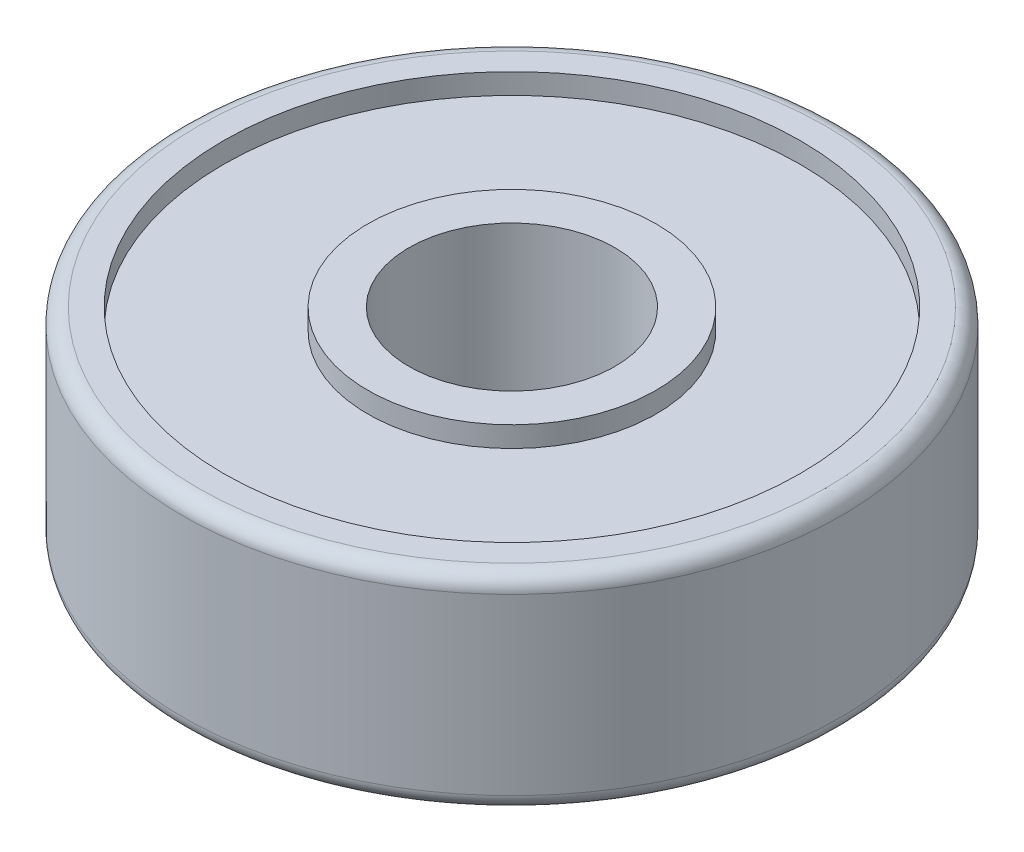
ISO-10303-21;
HEADER;
FILE_DESCRIPTION(('STEP AP214'),'2;1');
FILE_NAME('part.step','',(''),(''),'','','');
FILE_SCHEMA(('AUTOMOTIVE_DESIGN { 1 0 10303 214 1 1 1 1 }'));
ENDSEC;
DATA;
#1=APPLICATION_CONTEXT('core data for automotive mechanical design processes');
#2=APPLICATION_PROTOCOL_DEFINITION('international standard','automotive_design',2000,#1);
#3=PRODUCT_CONTEXT('',#1,'mechanical');
#4=PRODUCT('Part','Part','',(#3));
#5=PRODUCT_RELATED_PRODUCT_CATEGORY('part','',(#4));
#6=PRODUCT_DEFINITION_FORMATION('','',#4);
#7=PRODUCT_DEFINITION_CONTEXT('part definition',#1,'design');
#8=PRODUCT_DEFINITION('design','',#6,#7);
#9=PRODUCT_DEFINITION_SHAPE('','',#8);
#10=(LENGTH_UNIT() NAMED_UNIT(*) SI_UNIT(.MILLI.,.METRE.));
#11=(NAMED_UNIT(*) PLANE_ANGLE_UNIT() SI_UNIT($,.RADIAN.));
#12=(NAMED_UNIT(*) SI_UNIT($,.STERADIAN.) SOLID_ANGLE_UNIT());
#13=UNCERTAINTY_MEASURE_WITH_UNIT(LENGTH_MEASURE(1.E-05),#10,'distance_accuracy_value','');
#14=(GEOMETRIC_REPRESENTATION_CONTEXT(3) GLOBAL_UNCERTAINTY_ASSIGNED_CONTEXT((#13)) GLOBAL_UNIT_ASSIGNED_CONTEXT((#10,
#11,#12)) REPRESENTATION_CONTEXT('',''));
#15=CARTESIAN_POINT('',(0.,0.,0.));
#16=DIRECTION('',(0.,0.,1.));
#17=DIRECTION('',(1.,0.,0.));
#18=AXIS2_PLACEMENT_3D('',#15,#16,#17);
#19=CARTESIAN_POINT('',(0.,0.,0.));
#20=DIRECTION('',(0.,-1.,0.));
#21=DIRECTION('',(0.,0.,-1.));
#22=AXIS2_PLACEMENT_3D('',#19,#20,#21);
#23=TOROIDAL_SURFACE('',#22,5.2,1.75);
#24=ADVANCED_FACE('P0_F13',(),#23,.T.);
#25=CLOSED_SHELL('',(#24));
#26=MANIFOLD_SOLID_BREP('P0_B1',#25);
#27=CARTESIAN_POINT('',(0.,2.75,0.));
#28=DIRECTION('',(0.,-1.,0.));
#29=DIRECTION('',(0.,0.,-1.));
#30=AXIS2_PLACEMENT_3D('',#27,#28,#29);
#31=CYLINDRICAL_SURFACE('',#30,2.5);
#32=CARTESIAN_POINT('',(0.,-2.5,0.));
#33=DIRECTION('',(0.,-1.,0.));
#34=DIRECTION('',(0.,0.,-1.));
#35=AXIS2_PLACEMENT_3D('',#32,#33,#34);
#36=CIRCLE('',#35,2.5);
#37=CARTESIAN_POINT('',(0.,-2.5,-2.5));
#38=VERTEX_POINT('',#37);
#39=EDGE_CURVE('P1_E155',#38,#38,#36,.F.);
#40=ORIENTED_EDGE('',*,*,#39,.F.);
#41=EDGE_LOOP('',(#40));
#42=FACE_BOUND('',#41,.T.);
#43=CARTESIAN_POINT('',(0.,2.5,0.));
#44=DIRECTION('',(0.,-1.,0.));
#45=DIRECTION('',(0.,0.,-1.));
#46=AXIS2_PLACEMENT_3D('',#43,#44,#45);
#47=CIRCLE('',#46,2.5);
#48=CARTESIAN_POINT('',(0.,2.5,-2.5));
#49=VERTEX_POINT('',#48);
#50=EDGE_CURVE('P1_E17',#49,#49,#47,.F.);
#51=ORIENTED_EDGE('',*,*,#50,.T.);
#52=EDGE_LOOP('',(#51));
#53=FACE_BOUND('',#52,.T.);
#54=ADVANCED_FACE('P1_F14',(#42,#53),#31,.F.);
#55=CARTESIAN_POINT('',(0.,2.5,0.));
#56=DIRECTION('',(0.,-1.,0.));
#57=DIRECTION('',(0.,0.,-1.));
#58=AXIS2_PLACEMENT_3D('',#55,#56,#57);
#59=PLANE('',#58);
#60=ORIENTED_EDGE('',*,*,#50,.F.);
#61=EDGE_LOOP('',(#60));
#62=FACE_BOUND('',#61,.T.);
#63=CARTESIAN_POINT('',(0.,2.5,0.));
#64=DIRECTION('',(0.,-1.,0.));
#65=DIRECTION('',(0.,0.,-1.));
#66=AXIS2_PLACEMENT_3D('',#63,#64,#65);
#67=CIRCLE('',#66,3.5);
#68=CARTESIAN_POINT('',(0.,2.5,-3.5));
#69=VERTEX_POINT('',#68);
#70=EDGE_CURVE('P1_E153',#69,#69,#67,.T.);
#71=ORIENTED_EDGE('',*,*,#70,.F.);
#72=EDGE_LOOP('',(#71));
#73=FACE_BOUND('',#72,.T.);
#74=ADVANCED_FACE('P1_F108',(#62,#73),#59,.F.);
#75=CARTESIAN_POINT('',(0.,-2.5,0.));
#76=DIRECTION('',(0.,-1.,0.));
#77=DIRECTION('',(0.,0.,-1.));
#78=AXIS2_PLACEMENT_3D('',#75,#76,#77);
#79=PLANE('',#78);
#80=ORIENTED_EDGE('',*,*,#39,.T.);
#81=EDGE_LOOP('',(#80));
#82=FACE_BOUND('',#81,.T.);
#83=CARTESIAN_POINT('',(0.,-2.5,0.));
#84=DIRECTION('',(0.,-1.,0.));
#85=DIRECTION('',(0.,0.,-1.));
#86=AXIS2_PLACEMENT_3D('',#83,#84,#85);
#87=CIRCLE('',#86,3.5);
#88=CARTESIAN_POINT('',(0.,-2.5,-3.5));
#89=VERTEX_POINT('',#88);
#90=EDGE_CURVE('P1_E150',#89,#89,#87,.F.);
#91=ORIENTED_EDGE('',*,*,#90,.F.);
#92=EDGE_LOOP('',(#91));
#93=FACE_BOUND('',#92,.T.);
#94=ADVANCED_FACE('P1_F105',(#82,#93),#79,.T.);
#95=CARTESIAN_POINT('',(0.,2.75,0.));
#96=DIRECTION('',(0.,-1.,0.));
#97=DIRECTION('',(0.,0.,-1.));
#98=AXIS2_PLACEMENT_3D('',#95,#96,#97);
#99=CYLINDRICAL_SURFACE('',#98,3.5);
#100=ORIENTED_EDGE('',*,*,#70,.T.);
#101=EDGE_LOOP('',(#100));
#102=FACE_BOUND('',#101,.T.);
#103=CARTESIAN_POINT('',(0.,2.,0.));
#104=DIRECTION('',(0.,-1.,0.));
#105=DIRECTION('',(0.,0.,-1.));
#106=AXIS2_PLACEMENT_3D('',#103,#104,#105);
#107=CIRCLE('',#106,3.5);
#108=CARTESIAN_POINT('',(0.,2.,-3.5));
#109=VERTEX_POINT('',#108);
#110=EDGE_CURVE('P1_E147',#109,#109,#107,.F.);
#111=ORIENTED_EDGE('',*,*,#110,.T.);
#112=EDGE_LOOP('',(#111));
#113=FACE_BOUND('',#112,.T.);
#114=ADVANCED_FACE('P1_F101',(#102,#113),#99,.T.);
#115=CARTESIAN_POINT('',(0.,2.75,0.));
#116=DIRECTION('',(0.,-1.,0.));
#117=DIRECTION('',(0.,0.,-1.));
#118=AXIS2_PLACEMENT_3D('',#115,#116,#117);
#119=CYLINDRICAL_SURFACE('',#118,3.5);
#120=CARTESIAN_POINT('',(0.,-2.,0.));
#121=DIRECTION('',(0.,-1.,0.));
#122=DIRECTION('',(0.,0.,-1.));
#123=AXIS2_PLACEMENT_3D('',#120,#121,#122);
#124=CIRCLE('',#123,3.5);
#125=CARTESIAN_POINT('',(0.,-2.,-3.5));
#126=VERTEX_POINT('',#125);
#127=EDGE_CURVE('P1_E144',#126,#126,#124,.F.);
#128=ORIENTED_EDGE('',*,*,#127,.F.);
#129=EDGE_LOOP('',(#128));
#130=FACE_BOUND('',#129,.T.);
#131=ORIENTED_EDGE('',*,*,#90,.T.);
#132=EDGE_LOOP('',(#131));
#133=FACE_BOUND('',#132,.T.);
#134=ADVANCED_FACE('P1_F97',(#130,#133),#119,.T.);
#135=CARTESIAN_POINT('',(0.,2.,0.));
#136=DIRECTION('',(0.,-1.,0.));
#137=DIRECTION('',(0.,0.,-1.));
#138=AXIS2_PLACEMENT_3D('',#135,#136,#137);
#139=PLANE('',#138);
#140=ORIENTED_EDGE('',*,*,#110,.F.);
#141=EDGE_LOOP('',(#140));
#142=FACE_BOUND('',#141,.T.);
#143=CARTESIAN_POINT('',(0.,2.,0.));
#144=DIRECTION('',(0.,-1.,0.));
#145=DIRECTION('',(0.,0.,-1.));
#146=AXIS2_PLACEMENT_3D('',#143,#144,#145);
#147=CIRCLE('',#146,7.);
#148=CARTESIAN_POINT('',(0.,2.,-7.));
#149=VERTEX_POINT('',#148);
#150=EDGE_CURVE('P1_E141',#149,#149,#147,.F.);
#151=ORIENTED_EDGE('',*,*,#150,.T.);
#152=EDGE_LOOP('',(#151));
#153=FACE_BOUND('',#152,.T.);
#154=ADVANCED_FACE('P1_F93',(#142,#153),#139,.F.);
#155=CARTESIAN_POINT('',(0.,-2.,0.));
#156=DIRECTION('',(0.,-1.,0.));
#157=DIRECTION('',(0.,0.,-1.));
#158=AXIS2_PLACEMENT_3D('',#155,#156,#157);
#159=PLANE('',#158);
#160=ORIENTED_EDGE('',*,*,#127,.T.);
#161=EDGE_LOOP('',(#160));
#162=FACE_BOUND('',#161,.T.);
#163=CARTESIAN_POINT('',(0.,-2.,0.));
#164=DIRECTION('',(0.,-1.,0.));
#165=DIRECTION('',(0.,0.,-1.));
#166=AXIS2_PLACEMENT_3D('',#163,#164,#165);
#167=CIRCLE('',#166,7.);
#168=CARTESIAN_POINT('',(0.,-2.,-7.));
#169=VERTEX_POINT('',#168);
#170=EDGE_CURVE('P1_E134',#169,#169,#167,.T.);
#171=ORIENTED_EDGE('',*,*,#170,.T.);
#172=EDGE_LOOP('',(#171));
#173=FACE_BOUND('',#172,.T.);
#174=ADVANCED_FACE('P1_F89',(#162,#173),#159,.T.);
#175=CARTESIAN_POINT('',(0.,2.75,0.));
#176=DIRECTION('',(0.,-1.,0.));
#177=DIRECTION('',(0.,0.,-1.));
#178=AXIS2_PLACEMENT_3D('',#175,#176,#177);
#179=CYLINDRICAL_SURFACE('',#178,7.);
#180=ORIENTED_EDGE('',*,*,#150,.F.);
#181=EDGE_LOOP('',(#180));
#182=FACE_BOUND('',#181,.T.);
#183=CARTESIAN_POINT('',(0.,2.5,0.));
#184=DIRECTION('',(0.,-1.,0.));
#185=DIRECTION('',(0.,0.,-1.));
#186=AXIS2_PLACEMENT_3D('',#183,#184,#185);
#187=CIRCLE('',#186,7.);
#188=CARTESIAN_POINT('',(0.,2.5,-7.));
#189=VERTEX_POINT('',#188);
#190=EDGE_CURVE('P1_E129',#189,#189,#187,.F.);
#191=ORIENTED_EDGE('',*,*,#190,.T.);
#192=EDGE_LOOP('',(#191));
#193=FACE_BOUND('',#192,.T.);
#194=ADVANCED_FACE('P1_F85',(#182,#193),#179,.F.);
#195=CARTESIAN_POINT('',(0.,2.75,0.));
#196=DIRECTION('',(0.,-1.,0.));
#197=DIRECTION('',(0.,0.,-1.));
#198=AXIS2_PLACEMENT_3D('',#195,#196,#197);
#199=CYLINDRICAL_SURFACE('',#198,7.);
#200=CARTESIAN_POINT('',(0.,-2.5,0.));
#201=DIRECTION('',(0.,-1.,0.));
#202=DIRECTION('',(0.,0.,-1.));
#203=AXIS2_PLACEMENT_3D('',#200,#201,#202);
#204=CIRCLE('',#203,7.);
#205=CARTESIAN_POINT('',(0.,-2.5,-7.));
#206=VERTEX_POINT('',#205);
#207=EDGE_CURVE('P1_E127',#206,#206,#204,.F.);
#208=ORIENTED_EDGE('',*,*,#207,.F.);
#209=EDGE_LOOP('',(#208));
#210=FACE_BOUND('',#209,.T.);
#211=ORIENTED_EDGE('',*,*,#170,.F.);
#212=EDGE_LOOP('',(#211));
#213=FACE_BOUND('',#212,.T.);
#214=ADVANCED_FACE('P1_F80',(#210,#213),#199,.F.);
#215=CARTESIAN_POINT('',(0.,2.5,0.));
#216=DIRECTION('',(0.,-1.,0.));
#217=DIRECTION('',(0.,0.,-1.));
#218=AXIS2_PLACEMENT_3D('',#215,#216,#217);
#219=PLANE('',#218);
#220=ORIENTED_EDGE('',*,*,#190,.F.);
#221=EDGE_LOOP('',(#220));
#222=FACE_BOUND('',#221,.T.);
#223=CARTESIAN_POINT('',(0.,2.5,0.));
#224=DIRECTION('',(0.,-1.,0.));
#225=DIRECTION('',(1.,0.,0.));
#226=AXIS2_PLACEMENT_3D('',#223,#224,#225);
#227=CIRCLE('',#226,7.615);
#228=CARTESIAN_POINT('',(7.615,2.5,0.));
#229=VERTEX_POINT('',#228);
#230=EDGE_CURVE('P1_E64',#229,#229,#227,.T.);
#231=ORIENTED_EDGE('',*,*,#230,.F.);
#232=EDGE_LOOP('',(#231));
#233=FACE_BOUND('',#232,.T.);
#234=ADVANCED_FACE('P1_F70',(#222,#233),#219,.F.);
#235=CARTESIAN_POINT('',(0.,-2.5,0.));
#236=DIRECTION('',(0.,-1.,0.));
#237=DIRECTION('',(0.,0.,-1.));
#238=AXIS2_PLACEMENT_3D('',#235,#236,#237);
#239=PLANE('',#238);
#240=ORIENTED_EDGE('',*,*,#207,.T.);
#241=EDGE_LOOP('',(#240));
#242=FACE_BOUND('',#241,.T.);
#243=CARTESIAN_POINT('',(0.,-2.5,0.));
#244=DIRECTION('',(0.,1.,0.));
#245=DIRECTION('',(1.,0.,0.));
#246=AXIS2_PLACEMENT_3D('',#243,#244,#245);
#247=CIRCLE('',#246,7.615);
#248=CARTESIAN_POINT('',(7.615,-2.5,0.));
#249=VERTEX_POINT('',#248);
#250=EDGE_CURVE('P1_E26',#249,#249,#247,.T.);
#251=ORIENTED_EDGE('',*,*,#250,.F.);
#252=EDGE_LOOP('',(#251));
#253=FACE_BOUND('',#252,.T.);
#254=ADVANCED_FACE('P1_F79',(#242,#253),#239,.T.);
#255=CARTESIAN_POINT('',(0.,2.115,0.));
#256=DIRECTION('',(0.,-1.,0.));
#257=DIRECTION('',(0.,0.,-1.));
#258=AXIS2_PLACEMENT_3D('',#255,#256,#257);
#259=TOROIDAL_SURFACE('',#258,7.615,0.385);
#260=CARTESIAN_POINT('',(0.,2.115,0.));
#261=DIRECTION('',(0.,-1.,0.));
#262=DIRECTION('',(0.,0.,-1.));
#263=AXIS2_PLACEMENT_3D('',#260,#261,#262);
#264=CIRCLE('',#263,8.);
#265=CARTESIAN_POINT('',(0.,2.115,-8.));
#266=VERTEX_POINT('',#265);
#267=EDGE_CURVE('P1_E21',#266,#266,#264,.T.);
#268=ORIENTED_EDGE('',*,*,#267,.F.);
#269=EDGE_LOOP('',(#268));
#270=FACE_BOUND('',#269,.T.);
#271=ORIENTED_EDGE('',*,*,#230,.T.);
#272=EDGE_LOOP('',(#271));
#273=FACE_BOUND('',#272,.T.);
#274=ADVANCED_FACE('P1_F44',(#270,#273),#259,.T.);
#275=CARTESIAN_POINT('',(0.,-2.115,0.));
#276=DIRECTION('',(0.,-1.,0.));
#277=DIRECTION('',(0.,0.,-1.));
#278=AXIS2_PLACEMENT_3D('',#275,#276,#277);
#279=TOROIDAL_SURFACE('',#278,7.615,0.385);
#280=ORIENTED_EDGE('',*,*,#250,.T.);
#281=EDGE_LOOP('',(#280));
#282=FACE_BOUND('',#281,.T.);
#283=CARTESIAN_POINT('',(0.,-2.115,0.));
#284=DIRECTION('',(0.,-1.,0.));
#285=DIRECTION('',(0.,0.,-1.));
#286=AXIS2_PLACEMENT_3D('',#283,#284,#285);
#287=CIRCLE('',#286,8.);
#288=CARTESIAN_POINT('',(0.,-2.115,-8.));
#289=VERTEX_POINT('',#288);
#290=EDGE_CURVE('P1_E10',#289,#289,#287,.F.);
#291=ORIENTED_EDGE('',*,*,#290,.F.);
#292=EDGE_LOOP('',(#291));
#293=FACE_BOUND('',#292,.T.);
#294=ADVANCED_FACE('P1_F38',(#282,#293),#279,.T.);
#295=CARTESIAN_POINT('',(0.,2.75,0.));
#296=DIRECTION('',(0.,-1.,0.));
#297=DIRECTION('',(0.,0.,-1.));
#298=AXIS2_PLACEMENT_3D('',#295,#296,#297);
#299=CYLINDRICAL_SURFACE('',#298,8.);
#300=ORIENTED_EDGE('',*,*,#290,.T.);
#301=EDGE_LOOP('',(#300));
#302=FACE_BOUND('',#301,.T.);
#303=ORIENTED_EDGE('',*,*,#267,.T.);
#304=EDGE_LOOP('',(#303));
#305=FACE_BOUND('',#304,.T.);
#306=ADVANCED_FACE('P1_F43',(#302,#305),#299,.T.);
#307=CLOSED_SHELL('',(#54,#74,#94,#114,#134,#154,#174,#194,#214,#234,#254,#274,#294,#306));
#308=MANIFOLD_SOLID_BREP('P1_B1',#307);
#309=ADVANCED_BREP_SHAPE_REPRESENTATION('',(#18,#26,#308),#14);
#310=SHAPE_DEFINITION_REPRESENTATION(#9,#309);
ENDSEC;
END-ISO-10303-21;
